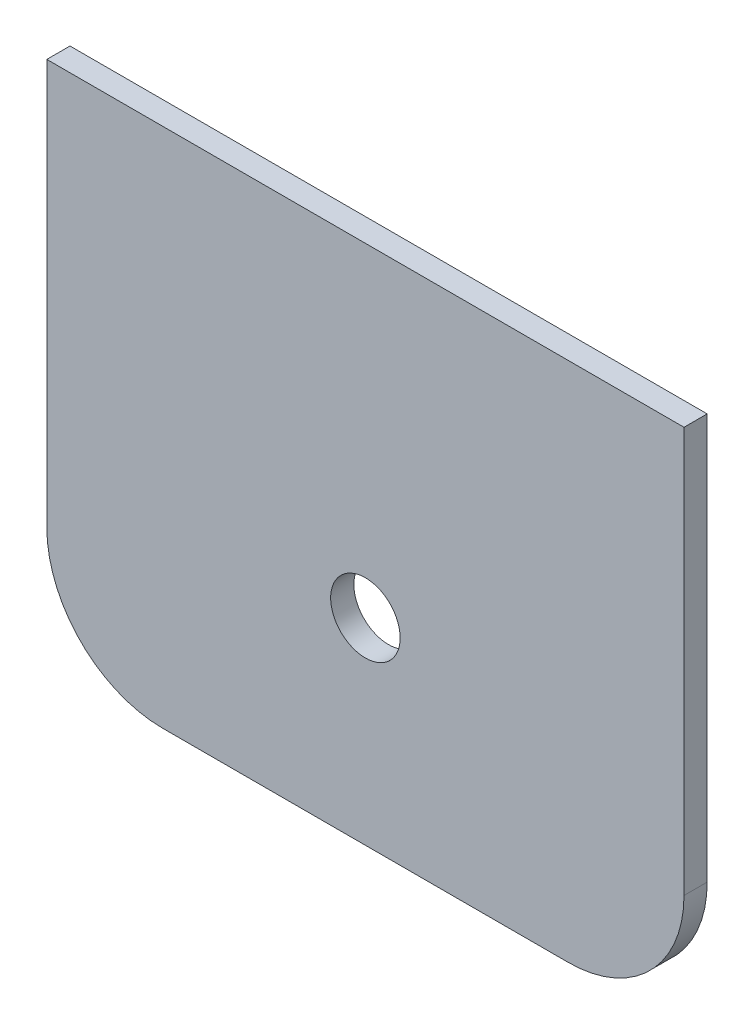
ISO-10303-21;
HEADER;
FILE_DESCRIPTION(('STEP AP214'),'2;1');
FILE_NAME('part.step','',(''),(''),'','','');
FILE_SCHEMA(('AUTOMOTIVE_DESIGN { 1 0 10303 214 1 1 1 1 }'));
ENDSEC;
DATA;
#1=APPLICATION_CONTEXT('core data for automotive mechanical design processes');
#2=APPLICATION_PROTOCOL_DEFINITION('international standard','automotive_design',2000,#1);
#3=PRODUCT_CONTEXT('',#1,'mechanical');
#4=PRODUCT('Part','Part','',(#3));
#5=PRODUCT_RELATED_PRODUCT_CATEGORY('part','',(#4));
#6=PRODUCT_DEFINITION_FORMATION('','',#4);
#7=PRODUCT_DEFINITION_CONTEXT('part definition',#1,'design');
#8=PRODUCT_DEFINITION('design','',#6,#7);
#9=PRODUCT_DEFINITION_SHAPE('','',#8);
#10=(LENGTH_UNIT() NAMED_UNIT(*) SI_UNIT(.MILLI.,.METRE.));
#11=(NAMED_UNIT(*) PLANE_ANGLE_UNIT() SI_UNIT($,.RADIAN.));
#12=(NAMED_UNIT(*) SI_UNIT($,.STERADIAN.) SOLID_ANGLE_UNIT());
#13=UNCERTAINTY_MEASURE_WITH_UNIT(LENGTH_MEASURE(1.E-05),#10,'distance_accuracy_value','');
#14=(GEOMETRIC_REPRESENTATION_CONTEXT(3) GLOBAL_UNCERTAINTY_ASSIGNED_CONTEXT((#13)) GLOBAL_UNIT_ASSIGNED_CONTEXT((#10,
#11,#12)) REPRESENTATION_CONTEXT('',''));
#15=CARTESIAN_POINT('',(0.,0.,0.));
#16=DIRECTION('',(0.,0.,1.));
#17=DIRECTION('',(1.,0.,0.));
#18=AXIS2_PLACEMENT_3D('',#15,#16,#17);
#19=CARTESIAN_POINT('',(17.5,709.422450469632,2.));
#20=DIRECTION('',(0.,0.,-1.));
#21=DIRECTION('',(-1.,0.,0.));
#22=AXIS2_PLACEMENT_3D('',#19,#20,#21);
#23=CYLINDRICAL_SURFACE('',#22,10.);
#24=DIRECTION('',(0.,0.,-1.));
#25=VECTOR('',#24,1.);
#26=CARTESIAN_POINT('',(27.5,709.422450469632,2.));
#27=LINE('',#26,#25);
#28=CARTESIAN_POINT('',(27.5,709.422450469632,2.));
#29=VERTEX_POINT('',#28);
#30=CARTESIAN_POINT('',(27.5,709.422450469632,0.));
#31=VERTEX_POINT('',#30);
#32=EDGE_CURVE('E122',#29,#31,#27,.T.);
#33=ORIENTED_EDGE('',*,*,#32,.F.);
#34=CARTESIAN_POINT('',(17.5,709.422450469632,2.));
#35=DIRECTION('',(0.,0.,-1.));
#36=DIRECTION('',(-1.,0.,0.));
#37=AXIS2_PLACEMENT_3D('',#34,#35,#36);
#38=CIRCLE('',#37,10.);
#39=CARTESIAN_POINT('',(17.5,699.422450469632,2.));
#40=VERTEX_POINT('',#39);
#41=EDGE_CURVE('E41',#40,#29,#38,.F.);
#42=ORIENTED_EDGE('',*,*,#41,.F.);
#43=DIRECTION('',(0.,0.,-1.));
#44=VECTOR('',#43,1.);
#45=CARTESIAN_POINT('',(17.5,699.422450469632,2.));
#46=LINE('',#45,#44);
#47=CARTESIAN_POINT('',(17.5,699.422450469632,0.));
#48=VERTEX_POINT('',#47);
#49=EDGE_CURVE('E124',#48,#40,#46,.F.);
#50=ORIENTED_EDGE('',*,*,#49,.F.);
#51=CARTESIAN_POINT('',(17.5,709.422450469632,0.));
#52=DIRECTION('',(0.,0.,-1.));
#53=DIRECTION('',(-1.,0.,0.));
#54=AXIS2_PLACEMENT_3D('',#51,#52,#53);
#55=CIRCLE('',#54,10.);
#56=EDGE_CURVE('E11',#31,#48,#55,.T.);
#57=ORIENTED_EDGE('',*,*,#56,.F.);
#58=EDGE_LOOP('',(#33,#42,#50,#57));
#59=FACE_BOUND('',#58,.T.);
#60=ADVANCED_FACE('F34',(#59),#23,.T.);
#61=CARTESIAN_POINT('',(-17.5,709.422450469632,2.));
#62=DIRECTION('',(0.,0.,-1.));
#63=DIRECTION('',(-1.,0.,0.));
#64=AXIS2_PLACEMENT_3D('',#61,#62,#63);
#65=CYLINDRICAL_SURFACE('',#64,10.);
#66=DIRECTION('',(0.,0.,-1.));
#67=VECTOR('',#66,1.);
#68=CARTESIAN_POINT('',(-17.5,699.422450469632,2.));
#69=LINE('',#68,#67);
#70=CARTESIAN_POINT('',(-17.5,699.422450469632,2.));
#71=VERTEX_POINT('',#70);
#72=CARTESIAN_POINT('',(-17.5,699.422450469632,0.));
#73=VERTEX_POINT('',#72);
#74=EDGE_CURVE('E107',#71,#73,#69,.T.);
#75=ORIENTED_EDGE('',*,*,#74,.F.);
#76=CARTESIAN_POINT('',(-17.5,709.422450469632,2.));
#77=DIRECTION('',(0.,0.,-1.));
#78=DIRECTION('',(-1.,0.,0.));
#79=AXIS2_PLACEMENT_3D('',#76,#77,#78);
#80=CIRCLE('',#79,10.);
#81=CARTESIAN_POINT('',(-27.5,709.422450469632,2.));
#82=VERTEX_POINT('',#81);
#83=EDGE_CURVE('E118',#82,#71,#80,.F.);
#84=ORIENTED_EDGE('',*,*,#83,.F.);
#85=DIRECTION('',(0.,0.,-1.));
#86=VECTOR('',#85,1.);
#87=CARTESIAN_POINT('',(-27.5,709.422450469632,2.));
#88=LINE('',#87,#86);
#89=CARTESIAN_POINT('',(-27.5,709.422450469632,0.));
#90=VERTEX_POINT('',#89);
#91=EDGE_CURVE('E110',#90,#82,#88,.F.);
#92=ORIENTED_EDGE('',*,*,#91,.F.);
#93=CARTESIAN_POINT('',(-17.5,709.422450469632,0.));
#94=DIRECTION('',(0.,0.,-1.));
#95=DIRECTION('',(-1.,0.,0.));
#96=AXIS2_PLACEMENT_3D('',#93,#94,#95);
#97=CIRCLE('',#96,10.);
#98=EDGE_CURVE('E120',#73,#90,#97,.T.);
#99=ORIENTED_EDGE('',*,*,#98,.F.);
#100=EDGE_LOOP('',(#75,#84,#92,#99));
#101=FACE_BOUND('',#100,.T.);
#102=ADVANCED_FACE('F145',(#101),#65,.T.);
#103=CARTESIAN_POINT('',(27.5,744.422450469632,2.));
#104=DIRECTION('',(-1.,0.,0.));
#105=DIRECTION('',(0.,-1.,0.));
#106=AXIS2_PLACEMENT_3D('',#103,#104,#105);
#107=PLANE('',#106);
#108=DIRECTION('',(0.,1.,0.));
#109=VECTOR('',#108,1.);
#110=CARTESIAN_POINT('',(27.5,744.422450469632,2.));
#111=LINE('',#110,#109);
#112=CARTESIAN_POINT('',(27.5,744.422450469632,2.));
#113=VERTEX_POINT('',#112);
#114=EDGE_CURVE('E83',#29,#113,#111,.T.);
#115=ORIENTED_EDGE('',*,*,#114,.F.);
#116=ORIENTED_EDGE('',*,*,#32,.T.);
#117=DIRECTION('',(0.,1.,0.));
#118=VECTOR('',#117,1.);
#119=CARTESIAN_POINT('',(27.5,744.422450469632,0.));
#120=LINE('',#119,#118);
#121=CARTESIAN_POINT('',(27.5,744.422450469632,0.));
#122=VERTEX_POINT('',#121);
#123=EDGE_CURVE('E105',#31,#122,#120,.T.);
#124=ORIENTED_EDGE('',*,*,#123,.T.);
#125=DIRECTION('',(0.,0.,-1.));
#126=VECTOR('',#125,1.);
#127=CARTESIAN_POINT('',(27.5,744.422450469632,2.));
#128=LINE('',#127,#126);
#129=EDGE_CURVE('E98',#113,#122,#128,.T.);
#130=ORIENTED_EDGE('',*,*,#129,.F.);
#131=EDGE_LOOP('',(#115,#116,#124,#130));
#132=FACE_BOUND('',#131,.T.);
#133=ADVANCED_FACE('F104',(#132),#107,.F.);
#134=CARTESIAN_POINT('',(-27.5,744.422450469632,2.));
#135=DIRECTION('',(0.,-1.,0.));
#136=DIRECTION('',(0.,0.,-1.));
#137=AXIS2_PLACEMENT_3D('',#134,#135,#136);
#138=PLANE('',#137);
#139=DIRECTION('',(-1.,0.,0.));
#140=VECTOR('',#139,1.);
#141=CARTESIAN_POINT('',(-27.5,744.422450469632,0.));
#142=LINE('',#141,#140);
#143=CARTESIAN_POINT('',(-27.5,744.422450469632,0.));
#144=VERTEX_POINT('',#143);
#145=EDGE_CURVE('E134',#122,#144,#142,.T.);
#146=ORIENTED_EDGE('',*,*,#145,.T.);
#147=DIRECTION('',(0.,0.,-1.));
#148=VECTOR('',#147,1.);
#149=CARTESIAN_POINT('',(-27.5,744.422450469632,2.));
#150=LINE('',#149,#148);
#151=CARTESIAN_POINT('',(-27.5,744.422450469632,2.));
#152=VERTEX_POINT('',#151);
#153=EDGE_CURVE('E100',#152,#144,#150,.T.);
#154=ORIENTED_EDGE('',*,*,#153,.F.);
#155=DIRECTION('',(-1.,0.,0.));
#156=VECTOR('',#155,1.);
#157=CARTESIAN_POINT('',(-27.5,744.422450469632,2.));
#158=LINE('',#157,#156);
#159=EDGE_CURVE('E88',#113,#152,#158,.T.);
#160=ORIENTED_EDGE('',*,*,#159,.F.);
#161=ORIENTED_EDGE('',*,*,#129,.T.);
#162=EDGE_LOOP('',(#146,#154,#160,#161));
#163=FACE_BOUND('',#162,.T.);
#164=ADVANCED_FACE('F97',(#163),#138,.F.);
#165=CARTESIAN_POINT('',(-27.5,699.422450469632,2.));
#166=DIRECTION('',(1.,0.,0.));
#167=DIRECTION('',(0.,0.,-1.));
#168=AXIS2_PLACEMENT_3D('',#165,#166,#167);
#169=PLANE('',#168);
#170=DIRECTION('',(0.,-1.,0.));
#171=VECTOR('',#170,1.);
#172=CARTESIAN_POINT('',(-27.5,699.422450469632,0.));
#173=LINE('',#172,#171);
#174=EDGE_CURVE('E137',#144,#90,#173,.T.);
#175=ORIENTED_EDGE('',*,*,#174,.T.);
#176=ORIENTED_EDGE('',*,*,#91,.T.);
#177=DIRECTION('',(0.,-1.,0.));
#178=VECTOR('',#177,1.);
#179=CARTESIAN_POINT('',(-27.5,699.422450469632,2.));
#180=LINE('',#179,#178);
#181=EDGE_CURVE('E102',#152,#82,#180,.T.);
#182=ORIENTED_EDGE('',*,*,#181,.F.);
#183=ORIENTED_EDGE('',*,*,#153,.T.);
#184=EDGE_LOOP('',(#175,#176,#182,#183));
#185=FACE_BOUND('',#184,.T.);
#186=ADVANCED_FACE('F141',(#185),#169,.F.);
#187=CARTESIAN_POINT('',(27.5,699.422450469632,2.));
#188=DIRECTION('',(0.,1.,0.));
#189=DIRECTION('',(0.,0.,1.));
#190=AXIS2_PLACEMENT_3D('',#187,#188,#189);
#191=PLANE('',#190);
#192=DIRECTION('',(1.,0.,0.));
#193=VECTOR('',#192,1.);
#194=CARTESIAN_POINT('',(27.5,699.422450469632,0.));
#195=LINE('',#194,#193);
#196=EDGE_CURVE('E93',#73,#48,#195,.T.);
#197=ORIENTED_EDGE('',*,*,#196,.T.);
#198=ORIENTED_EDGE('',*,*,#49,.T.);
#199=DIRECTION('',(1.,0.,0.));
#200=VECTOR('',#199,1.);
#201=CARTESIAN_POINT('',(27.5,699.422450469632,2.));
#202=LINE('',#201,#200);
#203=EDGE_CURVE('E112',#71,#40,#202,.T.);
#204=ORIENTED_EDGE('',*,*,#203,.F.);
#205=ORIENTED_EDGE('',*,*,#74,.T.);
#206=EDGE_LOOP('',(#197,#198,#204,#205));
#207=FACE_BOUND('',#206,.T.);
#208=ADVANCED_FACE('F128',(#207),#191,.F.);
#209=CARTESIAN_POINT('',(0.,0.,2.));
#210=DIRECTION('',(0.,0.,-1.));
#211=DIRECTION('',(-1.,0.,0.));
#212=AXIS2_PLACEMENT_3D('',#209,#210,#211);
#213=PLANE('',#212);
#214=CARTESIAN_POINT('',(0.,716.422450469631,2.));
#215=DIRECTION('',(0.,0.,1.));
#216=DIRECTION('',(1.,0.,0.));
#217=AXIS2_PLACEMENT_3D('',#214,#215,#216);
#218=CIRCLE('',#217,3.);
#219=CARTESIAN_POINT('',(3.00000000000001,716.422450469631,2.));
#220=VERTEX_POINT('',#219);
#221=EDGE_CURVE('E175',#220,#220,#218,.T.);
#222=ORIENTED_EDGE('',*,*,#221,.F.);
#223=EDGE_LOOP('',(#222));
#224=FACE_BOUND('',#223,.T.);
#225=ORIENTED_EDGE('',*,*,#203,.T.);
#226=ORIENTED_EDGE('',*,*,#41,.T.);
#227=ORIENTED_EDGE('',*,*,#114,.T.);
#228=ORIENTED_EDGE('',*,*,#159,.T.);
#229=ORIENTED_EDGE('',*,*,#181,.T.);
#230=ORIENTED_EDGE('',*,*,#83,.T.);
#231=EDGE_LOOP('',(#225,#226,#227,#228,#229,#230));
#232=FACE_BOUND('',#231,.T.);
#233=ADVANCED_FACE('F86',(#224,#232),#213,.F.);
#234=CARTESIAN_POINT('',(0.,0.,0.));
#235=DIRECTION('',(0.,0.,-1.));
#236=DIRECTION('',(-1.,0.,0.));
#237=AXIS2_PLACEMENT_3D('',#234,#235,#236);
#238=PLANE('',#237);
#239=CARTESIAN_POINT('',(0.,716.422450469631,0.));
#240=DIRECTION('',(0.,0.,1.));
#241=DIRECTION('',(1.,0.,0.));
#242=AXIS2_PLACEMENT_3D('',#239,#240,#241);
#243=CIRCLE('',#242,3.);
#244=CARTESIAN_POINT('',(3.00000000000001,716.422450469631,0.));
#245=VERTEX_POINT('',#244);
#246=EDGE_CURVE('E135',#245,#245,#243,.T.);
#247=ORIENTED_EDGE('',*,*,#246,.T.);
#248=EDGE_LOOP('',(#247));
#249=FACE_BOUND('',#248,.T.);
#250=ORIENTED_EDGE('',*,*,#123,.F.);
#251=ORIENTED_EDGE('',*,*,#56,.T.);
#252=ORIENTED_EDGE('',*,*,#196,.F.);
#253=ORIENTED_EDGE('',*,*,#98,.T.);
#254=ORIENTED_EDGE('',*,*,#174,.F.);
#255=ORIENTED_EDGE('',*,*,#145,.F.);
#256=EDGE_LOOP('',(#250,#251,#252,#253,#254,#255));
#257=FACE_BOUND('',#256,.T.);
#258=ADVANCED_FACE('F143',(#249,#257),#238,.T.);
#259=CARTESIAN_POINT('',(0.,716.422450469631,0.));
#260=DIRECTION('',(0.,0.,1.));
#261=DIRECTION('',(1.,0.,0.));
#262=AXIS2_PLACEMENT_3D('',#259,#260,#261);
#263=CYLINDRICAL_SURFACE('',#262,3.);
#264=ORIENTED_EDGE('',*,*,#246,.F.);
#265=EDGE_LOOP('',(#264));
#266=FACE_BOUND('',#265,.T.);
#267=ORIENTED_EDGE('',*,*,#221,.T.);
#268=EDGE_LOOP('',(#267));
#269=FACE_BOUND('',#268,.T.);
#270=ADVANCED_FACE('F161',(#266,#269),#263,.F.);
#271=CLOSED_SHELL('',(#60,#102,#133,#164,#186,#208,#233,#258,#270));
#272=MANIFOLD_SOLID_BREP('B2',#271);
#273=ADVANCED_BREP_SHAPE_REPRESENTATION('',(#18,#272),#14);
#274=SHAPE_DEFINITION_REPRESENTATION(#9,#273);
ENDSEC;
END-ISO-10303-21;
